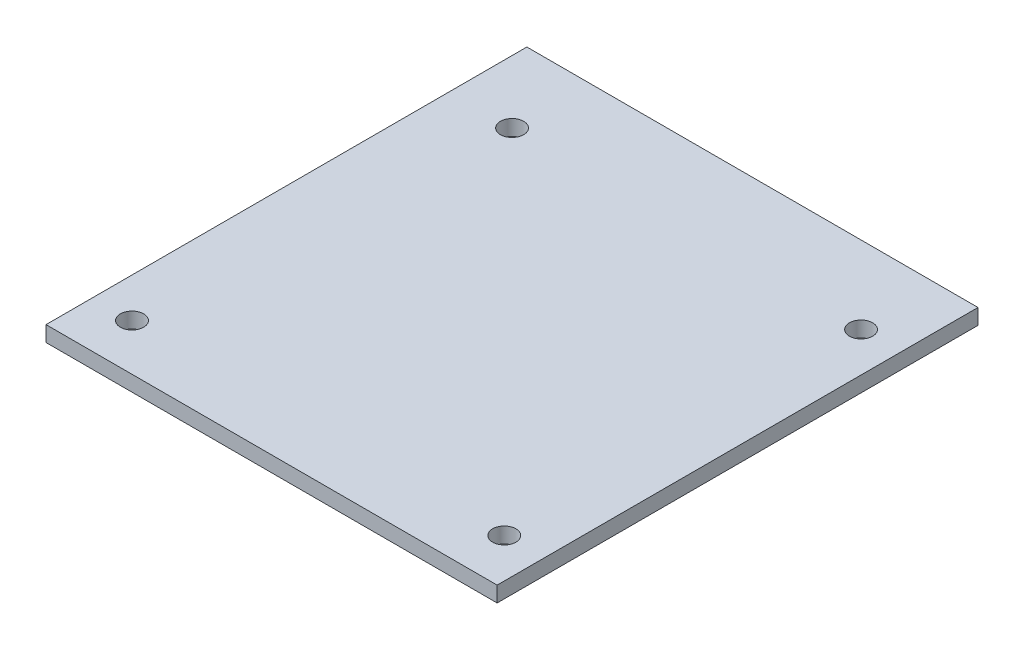
ISO-10303-21;
HEADER;
FILE_DESCRIPTION(('STEP AP214'),'2;1');
FILE_NAME('part.step','',(''),(''),'','','');
FILE_SCHEMA(('AUTOMOTIVE_DESIGN { 1 0 10303 214 1 1 1 1 }'));
ENDSEC;
DATA;
#1=APPLICATION_CONTEXT('core data for automotive mechanical design processes');
#2=APPLICATION_PROTOCOL_DEFINITION('international standard','automotive_design',2000,#1);
#3=PRODUCT_CONTEXT('',#1,'mechanical');
#4=PRODUCT('Part','Part','',(#3));
#5=PRODUCT_RELATED_PRODUCT_CATEGORY('part','',(#4));
#6=PRODUCT_DEFINITION_FORMATION('','',#4);
#7=PRODUCT_DEFINITION_CONTEXT('part definition',#1,'design');
#8=PRODUCT_DEFINITION('design','',#6,#7);
#9=PRODUCT_DEFINITION_SHAPE('','',#8);
#10=(LENGTH_UNIT() NAMED_UNIT(*) SI_UNIT(.MILLI.,.METRE.));
#11=(NAMED_UNIT(*) PLANE_ANGLE_UNIT() SI_UNIT($,.RADIAN.));
#12=(NAMED_UNIT(*) SI_UNIT($,.STERADIAN.) SOLID_ANGLE_UNIT());
#13=UNCERTAINTY_MEASURE_WITH_UNIT(LENGTH_MEASURE(1.E-05),#10,'distance_accuracy_value','');
#14=(GEOMETRIC_REPRESENTATION_CONTEXT(3) GLOBAL_UNCERTAINTY_ASSIGNED_CONTEXT((#13)) GLOBAL_UNIT_ASSIGNED_CONTEXT((#10,
#11,#12)) REPRESENTATION_CONTEXT('',''));
#15=CARTESIAN_POINT('',(0.,0.,0.));
#16=DIRECTION('',(0.,0.,1.));
#17=DIRECTION('',(1.,0.,0.));
#18=AXIS2_PLACEMENT_3D('',#15,#16,#17);
#19=CARTESIAN_POINT('',(0.,2.,0.));
#20=DIRECTION('',(0.,-1.,0.));
#21=DIRECTION('',(0.,0.,-1.));
#22=AXIS2_PLACEMENT_3D('',#19,#20,#21);
#23=PLANE('',#22);
#24=DIRECTION('',(0.,0.,-1.));
#25=VECTOR('',#24,1.);
#26=CARTESIAN_POINT('',(29.085,2.,31.));
#27=LINE('',#26,#25);
#28=CARTESIAN_POINT('',(29.085,2.,31.));
#29=VERTEX_POINT('',#28);
#30=CARTESIAN_POINT('',(29.085,2.,-31.));
#31=VERTEX_POINT('',#30);
#32=EDGE_CURVE('E92',#29,#31,#27,.T.);
#33=ORIENTED_EDGE('',*,*,#32,.T.);
#34=DIRECTION('',(-1.,0.,0.));
#35=VECTOR('',#34,1.);
#36=CARTESIAN_POINT('',(-29.085,2.,-31.));
#37=LINE('',#36,#35);
#38=CARTESIAN_POINT('',(-29.085,2.,-31.));
#39=VERTEX_POINT('',#38);
#40=EDGE_CURVE('E87',#31,#39,#37,.T.);
#41=ORIENTED_EDGE('',*,*,#40,.T.);
#42=DIRECTION('',(0.,0.,1.));
#43=VECTOR('',#42,1.);
#44=CARTESIAN_POINT('',(-29.085,2.,31.));
#45=LINE('',#44,#43);
#46=CARTESIAN_POINT('',(-29.085,2.,31.));
#47=VERTEX_POINT('',#46);
#48=EDGE_CURVE('E90',#39,#47,#45,.T.);
#49=ORIENTED_EDGE('',*,*,#48,.T.);
#50=DIRECTION('',(1.,0.,0.));
#51=VECTOR('',#50,1.);
#52=CARTESIAN_POINT('',(-29.085,2.,31.));
#53=LINE('',#52,#51);
#54=EDGE_CURVE('E57',#47,#29,#53,.T.);
#55=ORIENTED_EDGE('',*,*,#54,.T.);
#56=EDGE_LOOP('',(#33,#41,#49,#55));
#57=FACE_BOUND('',#56,.T.);
#58=CARTESIAN_POINT('',(24.005,2.,25.));
#59=DIRECTION('',(0.,1.,0.));
#60=DIRECTION('',(0.,0.,1.));
#61=AXIS2_PLACEMENT_3D('',#58,#59,#60);
#62=CIRCLE('',#61,1.5);
#63=CARTESIAN_POINT('',(24.005,2.,26.5));
#64=VERTEX_POINT('',#63);
#65=EDGE_CURVE('E112',#64,#64,#62,.T.);
#66=ORIENTED_EDGE('',*,*,#65,.F.);
#67=EDGE_LOOP('',(#66));
#68=FACE_BOUND('',#67,.T.);
#69=CARTESIAN_POINT('',(-23.995,2.,25.));
#70=DIRECTION('',(0.,1.,0.));
#71=DIRECTION('',(0.,0.,1.));
#72=AXIS2_PLACEMENT_3D('',#69,#70,#71);
#73=CIRCLE('',#72,1.5);
#74=CARTESIAN_POINT('',(-23.995,2.,26.5));
#75=VERTEX_POINT('',#74);
#76=EDGE_CURVE('E134',#75,#75,#73,.T.);
#77=ORIENTED_EDGE('',*,*,#76,.F.);
#78=EDGE_LOOP('',(#77));
#79=FACE_BOUND('',#78,.T.);
#80=CARTESIAN_POINT('',(24.005,2.,-21.));
#81=DIRECTION('',(0.,1.,0.));
#82=DIRECTION('',(0.,0.,1.));
#83=AXIS2_PLACEMENT_3D('',#80,#81,#82);
#84=CIRCLE('',#83,1.5);
#85=CARTESIAN_POINT('',(24.005,2.,-19.5));
#86=VERTEX_POINT('',#85);
#87=EDGE_CURVE('E142',#86,#86,#84,.T.);
#88=ORIENTED_EDGE('',*,*,#87,.F.);
#89=EDGE_LOOP('',(#88));
#90=FACE_BOUND('',#89,.T.);
#91=CARTESIAN_POINT('',(-20.995,2.,-21.));
#92=DIRECTION('',(0.,1.,0.));
#93=DIRECTION('',(0.,0.,1.));
#94=AXIS2_PLACEMENT_3D('',#91,#92,#93);
#95=CIRCLE('',#94,1.5);
#96=CARTESIAN_POINT('',(-20.995,2.,-19.5));
#97=VERTEX_POINT('',#96);
#98=EDGE_CURVE('E150',#97,#97,#95,.T.);
#99=ORIENTED_EDGE('',*,*,#98,.F.);
#100=EDGE_LOOP('',(#99));
#101=FACE_BOUND('',#100,.T.);
#102=ADVANCED_FACE('F39',(#57,#68,#79,#90,#101),#23,.F.);
#103=CARTESIAN_POINT('',(0.,0.,0.));
#104=DIRECTION('',(0.,-1.,0.));
#105=DIRECTION('',(0.,0.,-1.));
#106=AXIS2_PLACEMENT_3D('',#103,#104,#105);
#107=PLANE('',#106);
#108=CARTESIAN_POINT('',(24.005,0.,-21.));
#109=DIRECTION('',(0.,1.,0.));
#110=DIRECTION('',(0.,0.,1.));
#111=AXIS2_PLACEMENT_3D('',#108,#109,#110);
#112=CIRCLE('',#111,1.5);
#113=CARTESIAN_POINT('',(24.005,0.,-19.5));
#114=VERTEX_POINT('',#113);
#115=EDGE_CURVE('E146',#114,#114,#112,.T.);
#116=ORIENTED_EDGE('',*,*,#115,.T.);
#117=EDGE_LOOP('',(#116));
#118=FACE_BOUND('',#117,.T.);
#119=CARTESIAN_POINT('',(24.005,0.,25.));
#120=DIRECTION('',(0.,1.,0.));
#121=DIRECTION('',(0.,0.,1.));
#122=AXIS2_PLACEMENT_3D('',#119,#120,#121);
#123=CIRCLE('',#122,1.5);
#124=CARTESIAN_POINT('',(24.005,0.,26.5));
#125=VERTEX_POINT('',#124);
#126=EDGE_CURVE('E130',#125,#125,#123,.T.);
#127=ORIENTED_EDGE('',*,*,#126,.T.);
#128=EDGE_LOOP('',(#127));
#129=FACE_BOUND('',#128,.T.);
#130=DIRECTION('',(0.,0.,-1.));
#131=VECTOR('',#130,1.);
#132=CARTESIAN_POINT('',(29.085,0.,31.));
#133=LINE('',#132,#131);
#134=CARTESIAN_POINT('',(29.085,0.,31.));
#135=VERTEX_POINT('',#134);
#136=CARTESIAN_POINT('',(29.085,0.,-31.));
#137=VERTEX_POINT('',#136);
#138=EDGE_CURVE('E108',#135,#137,#133,.T.);
#139=ORIENTED_EDGE('',*,*,#138,.F.);
#140=DIRECTION('',(1.,0.,0.));
#141=VECTOR('',#140,1.);
#142=CARTESIAN_POINT('',(-29.085,0.,31.));
#143=LINE('',#142,#141);
#144=CARTESIAN_POINT('',(-29.085,0.,31.));
#145=VERTEX_POINT('',#144);
#146=EDGE_CURVE('E80',#145,#135,#143,.T.);
#147=ORIENTED_EDGE('',*,*,#146,.F.);
#148=DIRECTION('',(0.,0.,1.));
#149=VECTOR('',#148,1.);
#150=CARTESIAN_POINT('',(-29.085,0.,31.));
#151=LINE('',#150,#149);
#152=CARTESIAN_POINT('',(-29.085,0.,-31.));
#153=VERTEX_POINT('',#152);
#154=EDGE_CURVE('E74',#153,#145,#151,.T.);
#155=ORIENTED_EDGE('',*,*,#154,.F.);
#156=DIRECTION('',(-1.,0.,0.));
#157=VECTOR('',#156,1.);
#158=CARTESIAN_POINT('',(-29.085,0.,-31.));
#159=LINE('',#158,#157);
#160=EDGE_CURVE('E97',#137,#153,#159,.T.);
#161=ORIENTED_EDGE('',*,*,#160,.F.);
#162=EDGE_LOOP('',(#139,#147,#155,#161));
#163=FACE_BOUND('',#162,.T.);
#164=CARTESIAN_POINT('',(-23.995,0.,25.));
#165=DIRECTION('',(0.,1.,0.));
#166=DIRECTION('',(0.,0.,1.));
#167=AXIS2_PLACEMENT_3D('',#164,#165,#166);
#168=CIRCLE('',#167,1.5);
#169=CARTESIAN_POINT('',(-23.995,0.,26.5));
#170=VERTEX_POINT('',#169);
#171=EDGE_CURVE('E138',#170,#170,#168,.T.);
#172=ORIENTED_EDGE('',*,*,#171,.T.);
#173=EDGE_LOOP('',(#172));
#174=FACE_BOUND('',#173,.T.);
#175=CARTESIAN_POINT('',(-20.995,0.,-21.));
#176=DIRECTION('',(0.,1.,0.));
#177=DIRECTION('',(0.,0.,1.));
#178=AXIS2_PLACEMENT_3D('',#175,#176,#177);
#179=CIRCLE('',#178,1.5);
#180=CARTESIAN_POINT('',(-20.995,0.,-19.5));
#181=VERTEX_POINT('',#180);
#182=EDGE_CURVE('E154',#181,#181,#179,.T.);
#183=ORIENTED_EDGE('',*,*,#182,.T.);
#184=EDGE_LOOP('',(#183));
#185=FACE_BOUND('',#184,.T.);
#186=ADVANCED_FACE('F125',(#118,#129,#163,#174,#185),#107,.T.);
#187=CARTESIAN_POINT('',(29.085,2.,31.));
#188=DIRECTION('',(-1.,0.,0.));
#189=DIRECTION('',(0.,0.,1.));
#190=AXIS2_PLACEMENT_3D('',#187,#188,#189);
#191=PLANE('',#190);
#192=ORIENTED_EDGE('',*,*,#138,.T.);
#193=DIRECTION('',(0.,-1.,0.));
#194=VECTOR('',#193,1.);
#195=CARTESIAN_POINT('',(29.085,2.,-31.));
#196=LINE('',#195,#194);
#197=EDGE_CURVE('E11',#31,#137,#196,.T.);
#198=ORIENTED_EDGE('',*,*,#197,.F.);
#199=ORIENTED_EDGE('',*,*,#32,.F.);
#200=DIRECTION('',(0.,-1.,0.));
#201=VECTOR('',#200,1.);
#202=CARTESIAN_POINT('',(29.085,2.,31.));
#203=LINE('',#202,#201);
#204=EDGE_CURVE('E104',#29,#135,#203,.T.);
#205=ORIENTED_EDGE('',*,*,#204,.T.);
#206=EDGE_LOOP('',(#192,#198,#199,#205));
#207=FACE_BOUND('',#206,.T.);
#208=ADVANCED_FACE('F41',(#207),#191,.F.);
#209=CARTESIAN_POINT('',(-29.085,2.,-31.));
#210=DIRECTION('',(0.,0.,1.));
#211=DIRECTION('',(1.,0.,0.));
#212=AXIS2_PLACEMENT_3D('',#209,#210,#211);
#213=PLANE('',#212);
#214=ORIENTED_EDGE('',*,*,#160,.T.);
#215=DIRECTION('',(0.,-1.,0.));
#216=VECTOR('',#215,1.);
#217=CARTESIAN_POINT('',(-29.085,2.,-31.));
#218=LINE('',#217,#216);
#219=EDGE_CURVE('E49',#39,#153,#218,.T.);
#220=ORIENTED_EDGE('',*,*,#219,.F.);
#221=ORIENTED_EDGE('',*,*,#40,.F.);
#222=ORIENTED_EDGE('',*,*,#197,.T.);
#223=EDGE_LOOP('',(#214,#220,#221,#222));
#224=FACE_BOUND('',#223,.T.);
#225=ADVANCED_FACE('F96',(#224),#213,.F.);
#226=CARTESIAN_POINT('',(-29.085,2.,31.));
#227=DIRECTION('',(1.,0.,0.));
#228=DIRECTION('',(0.,0.,-1.));
#229=AXIS2_PLACEMENT_3D('',#226,#227,#228);
#230=PLANE('',#229);
#231=ORIENTED_EDGE('',*,*,#154,.T.);
#232=DIRECTION('',(0.,-1.,0.));
#233=VECTOR('',#232,1.);
#234=CARTESIAN_POINT('',(-29.085,2.,31.));
#235=LINE('',#234,#233);
#236=EDGE_CURVE('E99',#47,#145,#235,.T.);
#237=ORIENTED_EDGE('',*,*,#236,.F.);
#238=ORIENTED_EDGE('',*,*,#48,.F.);
#239=ORIENTED_EDGE('',*,*,#219,.T.);
#240=EDGE_LOOP('',(#231,#237,#238,#239));
#241=FACE_BOUND('',#240,.T.);
#242=ADVANCED_FACE('F100',(#241),#230,.F.);
#243=CARTESIAN_POINT('',(-29.085,2.,31.));
#244=DIRECTION('',(0.,0.,-1.));
#245=DIRECTION('',(-1.,0.,0.));
#246=AXIS2_PLACEMENT_3D('',#243,#244,#245);
#247=PLANE('',#246);
#248=ORIENTED_EDGE('',*,*,#146,.T.);
#249=ORIENTED_EDGE('',*,*,#204,.F.);
#250=ORIENTED_EDGE('',*,*,#54,.F.);
#251=ORIENTED_EDGE('',*,*,#236,.T.);
#252=EDGE_LOOP('',(#248,#249,#250,#251));
#253=FACE_BOUND('',#252,.T.);
#254=ADVANCED_FACE('F122',(#253),#247,.F.);
#255=CARTESIAN_POINT('',(24.005,2.,25.));
#256=DIRECTION('',(0.,-1.,0.));
#257=DIRECTION('',(0.,0.,-1.));
#258=AXIS2_PLACEMENT_3D('',#255,#256,#257);
#259=CYLINDRICAL_SURFACE('',#258,1.5);
#260=ORIENTED_EDGE('',*,*,#65,.T.);
#261=EDGE_LOOP('',(#260));
#262=FACE_BOUND('',#261,.T.);
#263=ORIENTED_EDGE('',*,*,#126,.F.);
#264=EDGE_LOOP('',(#263));
#265=FACE_BOUND('',#264,.T.);
#266=ADVANCED_FACE('F173',(#262,#265),#259,.F.);
#267=CARTESIAN_POINT('',(-23.995,2.,25.));
#268=DIRECTION('',(0.,-1.,0.));
#269=DIRECTION('',(0.,0.,-1.));
#270=AXIS2_PLACEMENT_3D('',#267,#268,#269);
#271=CYLINDRICAL_SURFACE('',#270,1.5);
#272=ORIENTED_EDGE('',*,*,#76,.T.);
#273=EDGE_LOOP('',(#272));
#274=FACE_BOUND('',#273,.T.);
#275=ORIENTED_EDGE('',*,*,#171,.F.);
#276=EDGE_LOOP('',(#275));
#277=FACE_BOUND('',#276,.T.);
#278=ADVANCED_FACE('F219',(#274,#277),#271,.F.);
#279=CARTESIAN_POINT('',(24.005,2.,-21.));
#280=DIRECTION('',(0.,-1.,0.));
#281=DIRECTION('',(0.,0.,-1.));
#282=AXIS2_PLACEMENT_3D('',#279,#280,#281);
#283=CYLINDRICAL_SURFACE('',#282,1.5);
#284=ORIENTED_EDGE('',*,*,#87,.T.);
#285=EDGE_LOOP('',(#284));
#286=FACE_BOUND('',#285,.T.);
#287=ORIENTED_EDGE('',*,*,#115,.F.);
#288=EDGE_LOOP('',(#287));
#289=FACE_BOUND('',#288,.T.);
#290=ADVANCED_FACE('F227',(#286,#289),#283,.F.);
#291=CARTESIAN_POINT('',(-20.995,2.,-21.));
#292=DIRECTION('',(0.,-1.,0.));
#293=DIRECTION('',(0.,0.,-1.));
#294=AXIS2_PLACEMENT_3D('',#291,#292,#293);
#295=CYLINDRICAL_SURFACE('',#294,1.5);
#296=ORIENTED_EDGE('',*,*,#98,.T.);
#297=EDGE_LOOP('',(#296));
#298=FACE_BOUND('',#297,.T.);
#299=ORIENTED_EDGE('',*,*,#182,.F.);
#300=EDGE_LOOP('',(#299));
#301=FACE_BOUND('',#300,.T.);
#302=ADVANCED_FACE('F162',(#298,#301),#295,.F.);
#303=CLOSED_SHELL('',(#102,#186,#208,#225,#242,#254,#266,#278,#290,#302));
#304=MANIFOLD_SOLID_BREP('B2',#303);
#305=ADVANCED_BREP_SHAPE_REPRESENTATION('',(#18,#304),#14);
#306=SHAPE_DEFINITION_REPRESENTATION(#9,#305);
ENDSEC;
END-ISO-10303-21;
